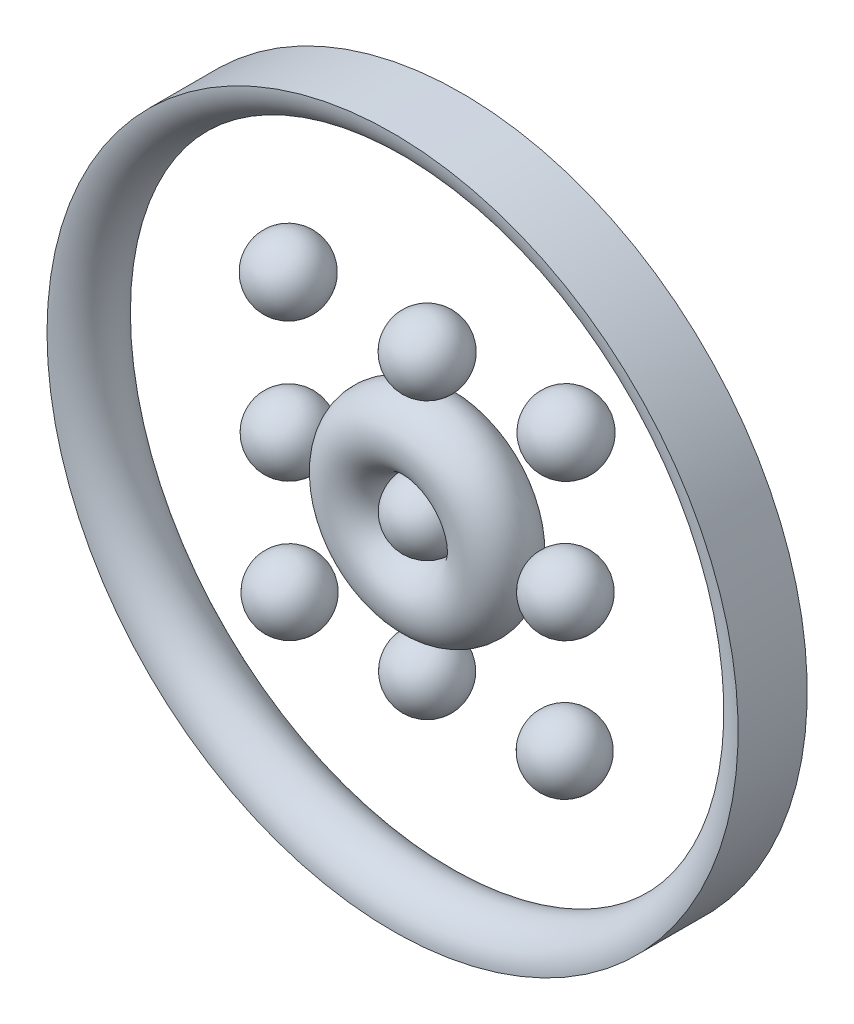
ISO-10303-21;
HEADER;
FILE_DESCRIPTION(('STEP AP214'),'2;1');
FILE_NAME('part.step','',(''),(''),'','','');
FILE_SCHEMA(('AUTOMOTIVE_DESIGN { 1 0 10303 214 1 1 1 1 }'));
ENDSEC;
DATA;
#1=APPLICATION_CONTEXT('core data for automotive mechanical design processes');
#2=APPLICATION_PROTOCOL_DEFINITION('international standard','automotive_design',2000,#1);
#3=PRODUCT_CONTEXT('',#1,'mechanical');
#4=PRODUCT('Part','Part','',(#3));
#5=PRODUCT_RELATED_PRODUCT_CATEGORY('part','',(#4));
#6=PRODUCT_DEFINITION_FORMATION('','',#4);
#7=PRODUCT_DEFINITION_CONTEXT('part definition',#1,'design');
#8=PRODUCT_DEFINITION('design','',#6,#7);
#9=PRODUCT_DEFINITION_SHAPE('','',#8);
#10=(LENGTH_UNIT() NAMED_UNIT(*) SI_UNIT(.MILLI.,.METRE.));
#11=(NAMED_UNIT(*) PLANE_ANGLE_UNIT() SI_UNIT($,.RADIAN.));
#12=(NAMED_UNIT(*) SI_UNIT($,.STERADIAN.) SOLID_ANGLE_UNIT());
#13=UNCERTAINTY_MEASURE_WITH_UNIT(LENGTH_MEASURE(1.E-05),#10,'distance_accuracy_value','');
#14=(GEOMETRIC_REPRESENTATION_CONTEXT(3) GLOBAL_UNCERTAINTY_ASSIGNED_CONTEXT((#13)) GLOBAL_UNIT_ASSIGNED_CONTEXT((#10,
#11,#12)) REPRESENTATION_CONTEXT('',''));
#15=CARTESIAN_POINT('',(0.,0.,0.));
#16=DIRECTION('',(0.,0.,1.));
#17=DIRECTION('',(1.,0.,0.));
#18=AXIS2_PLACEMENT_3D('',#15,#16,#17);
#19=CARTESIAN_POINT('',(0.,24696.9306697465,0.));
#20=DIRECTION('',(0.,0.,-1.));
#21=DIRECTION('',(-1.,0.,0.));
#22=AXIS2_PLACEMENT_3D('',#19,#20,#21);
#23=TOROIDAL_SURFACE('',#22,303.069330253464,30.3056322220137);
#24=CARTESIAN_POINT('',(0.,24696.9306697465,-30.3056322220137));
#25=DIRECTION('',(0.,0.,-1.));
#26=DIRECTION('',(-1.,0.,0.));
#27=AXIS2_PLACEMENT_3D('',#24,#25,#26);
#28=CIRCLE('',#27,303.069330253464);
#29=CARTESIAN_POINT('',(-303.069330253464,24696.9306697465,-30.3056322220137));
#30=VERTEX_POINT('',#29);
#31=EDGE_CURVE('E11',#30,#30,#28,.T.);
#32=ORIENTED_EDGE('',*,*,#31,.T.);
#33=EDGE_LOOP('',(#32));
#34=FACE_BOUND('',#33,.T.);
#35=CARTESIAN_POINT('',(0.,24696.9306697465,30.3056322220137));
#36=DIRECTION('',(0.,0.,-1.));
#37=DIRECTION('',(-1.,0.,0.));
#38=AXIS2_PLACEMENT_3D('',#35,#36,#37);
#39=CIRCLE('',#38,303.069330253464);
#40=CARTESIAN_POINT('',(-303.069330253464,24696.9306697465,30.3056322220137));
#41=VERTEX_POINT('',#40);
#42=EDGE_CURVE('E45',#41,#41,#39,.T.);
#43=ORIENTED_EDGE('',*,*,#42,.F.);
#44=EDGE_LOOP('',(#43));
#45=FACE_BOUND('',#44,.T.);
#46=ADVANCED_FACE('F39',(#34,#45),#23,.T.);
#47=CARTESIAN_POINT('',(0.,24696.9306697465,0.));
#48=DIRECTION('',(0.,0.,-1.));
#49=DIRECTION('',(-1.,0.,0.));
#50=AXIS2_PLACEMENT_3D('',#47,#48,#49);
#51=CYLINDRICAL_SURFACE('',#50,303.069330253464);
#52=ORIENTED_EDGE('',*,*,#42,.T.);
#53=EDGE_LOOP('',(#52));
#54=FACE_BOUND('',#53,.T.);
#55=ORIENTED_EDGE('',*,*,#31,.F.);
#56=EDGE_LOOP('',(#55));
#57=FACE_BOUND('',#56,.T.);
#58=ADVANCED_FACE('F51',(#54,#57),#51,.T.);
#59=CLOSED_SHELL('',(#46,#58));
#60=MANIFOLD_SOLID_BREP('B2',#59);
#61=CARTESIAN_POINT('',(0.,24696.9306697465,-2.54821997851783E-12));
#62=DIRECTION('',(0.,0.,-1.));
#63=DIRECTION('',(0.,1.,0.));
#64=AXIS2_PLACEMENT_3D('',#61,#62,#63);
#65=TOROIDAL_SURFACE('',#64,60.5410771924539,30.2333910657815);
#66=CARTESIAN_POINT('',(0.,24787.7051380048,-6.36898637848866E-12));
#67=VERTEX_POINT('',#66);
#68=VERTEX_LOOP('',#67);
#69=FACE_BOUND('',#68,.T.);
#70=ADVANCED_FACE('F76',(#69),#65,.T.);
#71=CLOSED_SHELL('',(#70));
#72=MANIFOLD_SOLID_BREP('B6',#71);
#73=CARTESIAN_POINT('',(-121.82683897138,24818.1604991532,0.));
#74=DIRECTION('',(1.,0.,0.));
#75=DIRECTION('',(0.,-1.,0.));
#76=AXIS2_PLACEMENT_3D('',#73,#74,#75);
#77=SPHERICAL_SURFACE('',#76,30.4568244113257);
#78=CARTESIAN_POINT('',(-91.3700145600548,24818.1604991532,0.));
#79=VERTEX_POINT('',#78);
#80=VERTEX_LOOP('',#79);
#81=FACE_BOUND('',#80,.T.);
#82=ADVANCED_FACE('F94',(#81),#77,.T.);
#83=CLOSED_SHELL('',(#82));
#84=MANIFOLD_SOLID_BREP('B35',#83);
#85=CARTESIAN_POINT('',(121.826838971592,24818.1604991532,0.));
#86=DIRECTION('',(1.,0.,0.));
#87=DIRECTION('',(0.,-1.,0.));
#88=AXIS2_PLACEMENT_3D('',#85,#86,#87);
#89=SPHERICAL_SURFACE('',#88,30.4568244113257);
#90=CARTESIAN_POINT('',(152.283663382917,24818.1604991532,0.));
#91=VERTEX_POINT('',#90);
#92=VERTEX_LOOP('',#91);
#93=FACE_BOUND('',#92,.T.);
#94=ADVANCED_FACE('F112',(#93),#89,.T.);
#95=CLOSED_SHELL('',(#94));
#96=MANIFOLD_SOLID_BREP('B72',#95);
#97=CARTESIAN_POINT('',(-121.230288078199,24696.6331252566,0.));
#98=DIRECTION('',(1.,0.,0.));
#99=DIRECTION('',(0.,-1.,0.));
#100=AXIS2_PLACEMENT_3D('',#97,#98,#99);
#101=SPHERICAL_SURFACE('',#100,30.3076861266731);
#102=CARTESIAN_POINT('',(-90.9226019515255,24696.6331252566,0.));
#103=VERTEX_POINT('',#102);
#104=VERTEX_LOOP('',#103);
#105=FACE_BOUND('',#104,.T.);
#106=ADVANCED_FACE('F130',(#105),#101,.T.);
#107=CLOSED_SHELL('',(#106));
#108=MANIFOLD_SOLID_BREP('B90',#107);
#109=CARTESIAN_POINT('',(121.230288078409,24696.6331252566,0.));
#110=DIRECTION('',(1.,0.,0.));
#111=DIRECTION('',(0.,-1.,0.));
#112=AXIS2_PLACEMENT_3D('',#109,#110,#111);
#113=SPHERICAL_SURFACE('',#112,30.3076861266732);
#114=CARTESIAN_POINT('',(151.537974205082,24696.6331252566,0.));
#115=VERTEX_POINT('',#114);
#116=VERTEX_LOOP('',#115);
#117=FACE_BOUND('',#116,.T.);
#118=ADVANCED_FACE('F148',(#117),#113,.T.);
#119=CLOSED_SHELL('',(#118));
#120=MANIFOLD_SOLID_BREP('B108',#119);
#121=CARTESIAN_POINT('',(-120.636658322891,24575.7008358589,0.));
#122=DIRECTION('',(1.,0.,0.));
#123=DIRECTION('',(0.,-1.,0.));
#124=AXIS2_PLACEMENT_3D('',#121,#122,#123);
#125=SPHERICAL_SURFACE('',#124,30.1592781289641);
#126=CARTESIAN_POINT('',(-90.4773801939264,24575.7008358589,0.));
#127=VERTEX_POINT('',#126);
#128=VERTEX_LOOP('',#127);
#129=FACE_BOUND('',#128,.T.);
#130=ADVANCED_FACE('F166',(#129),#125,.T.);
#131=CLOSED_SHELL('',(#130));
#132=MANIFOLD_SOLID_BREP('B126',#131);
#133=CARTESIAN_POINT('',(120.6366583231,24575.7008358589,0.));
#134=DIRECTION('',(1.,0.,0.));
#135=DIRECTION('',(0.,-1.,0.));
#136=AXIS2_PLACEMENT_3D('',#133,#134,#135);
#137=SPHERICAL_SURFACE('',#136,30.1592781289641);
#138=CARTESIAN_POINT('',(150.795936452064,24575.7008358589,0.));
#139=VERTEX_POINT('',#138);
#140=VERTEX_LOOP('',#139);
#141=FACE_BOUND('',#140,.T.);
#142=ADVANCED_FACE('F184',(#141),#137,.T.);
#143=CLOSED_SHELL('',(#142));
#144=MANIFOLD_SOLID_BREP('B144',#143);
#145=CARTESIAN_POINT('',(1.05522703792101E-10,24818.4595078023,0.));
#146=DIRECTION('',(1.,0.,0.));
#147=DIRECTION('',(0.,-1.,0.));
#148=AXIS2_PLACEMENT_3D('',#145,#146,#147);
#149=SPHERICAL_SURFACE('',#148,30.456824411335);
#150=CARTESIAN_POINT('',(30.4568244114405,24818.4595078023,0.));
#151=VERTEX_POINT('',#150);
#152=VERTEX_LOOP('',#151);
#153=FACE_BOUND('',#152,.T.);
#154=ADVANCED_FACE('F202',(#153),#149,.T.);
#155=CLOSED_SHELL('',(#154));
#156=MANIFOLD_SOLID_BREP('B162',#155);
#157=CARTESIAN_POINT('',(1.04495418417172E-10,24575.9969233593,0.));
#158=DIRECTION('',(1.,0.,0.));
#159=DIRECTION('',(0.,-1.,0.));
#160=AXIS2_PLACEMENT_3D('',#157,#158,#159);
#161=SPHERICAL_SURFACE('',#160,30.1592781289661);
#162=CARTESIAN_POINT('',(30.1592781290706,24575.9969233593,0.));
#163=VERTEX_POINT('',#162);
#164=VERTEX_LOOP('',#163);
#165=FACE_BOUND('',#164,.T.);
#166=ADVANCED_FACE('F219',(#165),#161,.T.);
#167=CLOSED_SHELL('',(#166));
#168=MANIFOLD_SOLID_BREP('B180',#167);
#169=CARTESIAN_POINT('',(1.0561719656257E-12,24696.9306697465,0.));
#170=DIRECTION('',(1.,0.,0.));
#171=DIRECTION('',(0.,-1.,0.));
#172=AXIS2_PLACEMENT_3D('',#169,#170,#171);
#173=SPHERICAL_SURFACE('',#172,30.3076861266726);
#174=CARTESIAN_POINT('',(30.3076861266737,24696.9306697465,0.));
#175=VERTEX_POINT('',#174);
#176=VERTEX_LOOP('',#175);
#177=FACE_BOUND('',#176,.T.);
#178=ADVANCED_FACE('F231',(#177),#173,.T.);
#179=CLOSED_SHELL('',(#178));
#180=MANIFOLD_SOLID_BREP('B198',#179);
#181=ADVANCED_BREP_SHAPE_REPRESENTATION('',(#18,#60,#72,#84,#96,#108,#120,#132,#144,#156,#168,
#180),#14);
#182=SHAPE_DEFINITION_REPRESENTATION(#9,#181);
ENDSEC;
END-ISO-10303-21;
